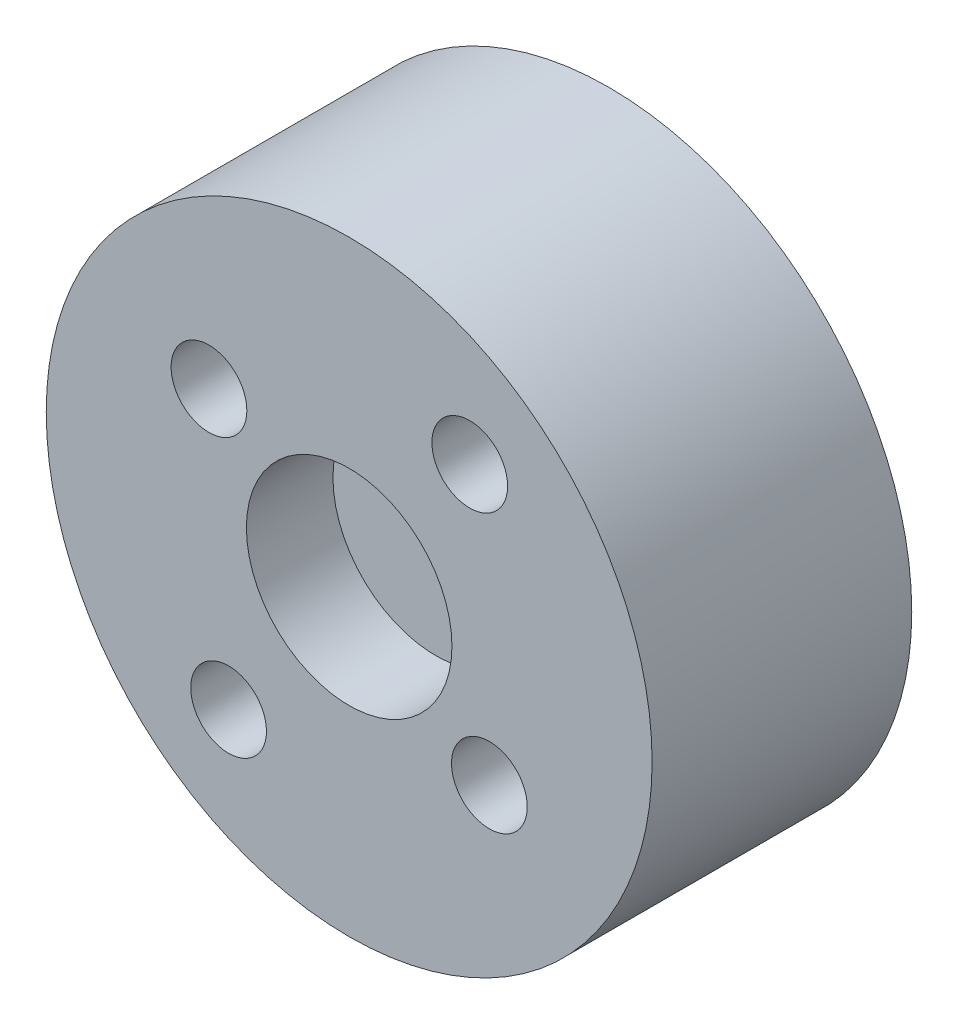
ISO-10303-21;
HEADER;
FILE_DESCRIPTION(('STEP AP214'),'2;1');
FILE_NAME('part.step','',(''),(''),'','','');
FILE_SCHEMA(('AUTOMOTIVE_DESIGN { 1 0 10303 214 1 1 1 1 }'));
ENDSEC;
DATA;
#1=APPLICATION_CONTEXT('core data for automotive mechanical design processes');
#2=APPLICATION_PROTOCOL_DEFINITION('international standard','automotive_design',2000,#1);
#3=PRODUCT_CONTEXT('',#1,'mechanical');
#4=PRODUCT('Part','Part','',(#3));
#5=PRODUCT_RELATED_PRODUCT_CATEGORY('part','',(#4));
#6=PRODUCT_DEFINITION_FORMATION('','',#4);
#7=PRODUCT_DEFINITION_CONTEXT('part definition',#1,'design');
#8=PRODUCT_DEFINITION('design','',#6,#7);
#9=PRODUCT_DEFINITION_SHAPE('','',#8);
#10=(LENGTH_UNIT() NAMED_UNIT(*) SI_UNIT(.MILLI.,.METRE.));
#11=(NAMED_UNIT(*) PLANE_ANGLE_UNIT() SI_UNIT($,.RADIAN.));
#12=(NAMED_UNIT(*) SI_UNIT($,.STERADIAN.) SOLID_ANGLE_UNIT());
#13=UNCERTAINTY_MEASURE_WITH_UNIT(LENGTH_MEASURE(1.E-05),#10,'distance_accuracy_value','');
#14=(GEOMETRIC_REPRESENTATION_CONTEXT(3) GLOBAL_UNCERTAINTY_ASSIGNED_CONTEXT((#13)) GLOBAL_UNIT_ASSIGNED_CONTEXT((#10,
#11,#12)) REPRESENTATION_CONTEXT('',''));
#15=CARTESIAN_POINT('',(0.,0.,0.));
#16=DIRECTION('',(0.,0.,1.));
#17=DIRECTION('',(1.,0.,0.));
#18=AXIS2_PLACEMENT_3D('',#15,#16,#17);
#19=CARTESIAN_POINT('',(0.,-2.76511214681213E-13,-39.5979797464465));
#20=DIRECTION('',(0.,0.,1.));
#21=DIRECTION('',(0.,-1.,0.));
#22=AXIS2_PLACEMENT_3D('',#19,#20,#21);
#23=CYLINDRICAL_SURFACE('',#22,14.);
#24=CARTESIAN_POINT('',(0.,0.,12.0000000000011));
#25=DIRECTION('',(0.,0.,-1.));
#26=DIRECTION('',(0.,1.,0.));
#27=AXIS2_PLACEMENT_3D('',#24,#25,#26);
#28=CIRCLE('',#27,14.);
#29=CARTESIAN_POINT('',(0.,14.0000000000001,12.000000000001));
#30=VERTEX_POINT('',#29);
#31=EDGE_CURVE('E38',#30,#30,#28,.T.);
#32=ORIENTED_EDGE('',*,*,#31,.T.);
#33=EDGE_LOOP('',(#32));
#34=FACE_BOUND('',#33,.T.);
#35=CARTESIAN_POINT('',(0.,0.,0.));
#36=DIRECTION('',(0.,0.,-1.));
#37=DIRECTION('',(-1.,0.,0.));
#38=AXIS2_PLACEMENT_3D('',#35,#36,#37);
#39=CIRCLE('',#38,14.);
#40=CARTESIAN_POINT('',(-14.,0.,0.));
#41=VERTEX_POINT('',#40);
#42=EDGE_CURVE('E10',#41,#41,#39,.T.);
#43=ORIENTED_EDGE('',*,*,#42,.F.);
#44=EDGE_LOOP('',(#43));
#45=FACE_BOUND('',#44,.T.);
#46=ADVANCED_FACE('F31',(#34,#45),#23,.T.);
#47=CARTESIAN_POINT('',(0.,0.,12.0000000000011));
#48=DIRECTION('',(0.,0.,-1.));
#49=DIRECTION('',(0.,1.,0.));
#50=AXIS2_PLACEMENT_3D('',#47,#48,#49);
#51=PLANE('',#50);
#52=CARTESIAN_POINT('',(0.,0.,12.0000000000011));
#53=DIRECTION('',(0.,0.,1.));
#54=DIRECTION('',(1.,0.,0.));
#55=AXIS2_PLACEMENT_3D('',#52,#53,#54);
#56=CIRCLE('',#55,4.75);
#57=CARTESIAN_POINT('',(4.75,0.,12.0000000000011));
#58=VERTEX_POINT('',#57);
#59=EDGE_CURVE('E70',#58,#58,#56,.T.);
#60=ORIENTED_EDGE('',*,*,#59,.F.);
#61=EDGE_LOOP('',(#60));
#62=FACE_BOUND('',#61,.T.);
#63=CARTESIAN_POINT('',(-5.57231761694233,-7.69410660024365,12.0000000000011));
#64=DIRECTION('',(0.,0.,1.));
#65=DIRECTION('',(1.,0.,0.));
#66=AXIS2_PLACEMENT_3D('',#63,#64,#65);
#67=CIRCLE('',#66,1.75);
#68=CARTESIAN_POINT('',(-3.82231761694233,-7.69410660024365,12.0000000000011));
#69=VERTEX_POINT('',#68);
#70=EDGE_CURVE('E52',#69,#69,#67,.T.);
#71=ORIENTED_EDGE('',*,*,#70,.F.);
#72=EDGE_LOOP('',(#71));
#73=FACE_BOUND('',#72,.T.);
#74=CARTESIAN_POINT('',(6.47924766336314,-4.69247799321451,12.0000000000011));
#75=DIRECTION('',(0.,0.,1.));
#76=DIRECTION('',(1.,0.,0.));
#77=AXIS2_PLACEMENT_3D('',#74,#75,#76);
#78=CIRCLE('',#77,1.75);
#79=CARTESIAN_POINT('',(8.22924766336314,-4.69247799321451,12.0000000000011));
#80=VERTEX_POINT('',#79);
#81=EDGE_CURVE('E59',#80,#80,#78,.T.);
#82=ORIENTED_EDGE('',*,*,#81,.F.);
#83=EDGE_LOOP('',(#82));
#84=FACE_BOUND('',#83,.T.);
#85=CARTESIAN_POINT('',(5.57231761694233,7.69410660024382,12.0000000000011));
#86=DIRECTION('',(0.,0.,1.));
#87=DIRECTION('',(1.,0.,0.));
#88=AXIS2_PLACEMENT_3D('',#85,#86,#87);
#89=CIRCLE('',#88,1.75);
#90=CARTESIAN_POINT('',(7.32231761694233,7.69410660024382,12.0000000000011));
#91=VERTEX_POINT('',#90);
#92=EDGE_CURVE('E65',#91,#91,#89,.T.);
#93=ORIENTED_EDGE('',*,*,#92,.F.);
#94=EDGE_LOOP('',(#93));
#95=FACE_BOUND('',#94,.T.);
#96=CARTESIAN_POINT('',(-6.47924766336314,4.69247799321468,12.0000000000011));
#97=DIRECTION('',(0.,0.,1.));
#98=DIRECTION('',(1.,0.,0.));
#99=AXIS2_PLACEMENT_3D('',#96,#97,#98);
#100=CIRCLE('',#99,1.75);
#101=CARTESIAN_POINT('',(-4.72924766336315,4.69247799321468,12.0000000000011));
#102=VERTEX_POINT('',#101);
#103=EDGE_CURVE('E46',#102,#102,#100,.T.);
#104=ORIENTED_EDGE('',*,*,#103,.F.);
#105=EDGE_LOOP('',(#104));
#106=FACE_BOUND('',#105,.T.);
#107=ORIENTED_EDGE('',*,*,#31,.F.);
#108=EDGE_LOOP('',(#107));
#109=FACE_BOUND('',#108,.T.);
#110=ADVANCED_FACE('F85',(#62,#73,#84,#95,#106,#109),#51,.F.);
#111=CARTESIAN_POINT('',(0.,0.,0.));
#112=DIRECTION('',(0.,0.,-1.));
#113=DIRECTION('',(0.,-1.,0.));
#114=AXIS2_PLACEMENT_3D('',#111,#112,#113);
#115=PLANE('',#114);
#116=CARTESIAN_POINT('',(-5.57231761694233,-7.69410660024365,0.));
#117=DIRECTION('',(0.,0.,1.));
#118=DIRECTION('',(1.,0.,0.));
#119=AXIS2_PLACEMENT_3D('',#116,#117,#118);
#120=CIRCLE('',#119,1.75);
#121=CARTESIAN_POINT('',(-3.82231761694233,-7.69410660024365,0.));
#122=VERTEX_POINT('',#121);
#123=EDGE_CURVE('E55',#122,#122,#120,.T.);
#124=ORIENTED_EDGE('',*,*,#123,.T.);
#125=EDGE_LOOP('',(#124));
#126=FACE_BOUND('',#125,.T.);
#127=CARTESIAN_POINT('',(6.47924766336314,-4.69247799321451,0.));
#128=DIRECTION('',(0.,0.,1.));
#129=DIRECTION('',(1.,0.,0.));
#130=AXIS2_PLACEMENT_3D('',#127,#128,#129);
#131=CIRCLE('',#130,1.75);
#132=CARTESIAN_POINT('',(8.22924766336314,-4.69247799321451,0.));
#133=VERTEX_POINT('',#132);
#134=EDGE_CURVE('E62',#133,#133,#131,.T.);
#135=ORIENTED_EDGE('',*,*,#134,.T.);
#136=EDGE_LOOP('',(#135));
#137=FACE_BOUND('',#136,.T.);
#138=CARTESIAN_POINT('',(5.57231761694233,7.69410660024382,0.));
#139=DIRECTION('',(0.,0.,1.));
#140=DIRECTION('',(1.,0.,0.));
#141=AXIS2_PLACEMENT_3D('',#138,#139,#140);
#142=CIRCLE('',#141,1.75);
#143=CARTESIAN_POINT('',(7.32231761694233,7.69410660024382,0.));
#144=VERTEX_POINT('',#143);
#145=EDGE_CURVE('E50',#144,#144,#142,.T.);
#146=ORIENTED_EDGE('',*,*,#145,.T.);
#147=EDGE_LOOP('',(#146));
#148=FACE_BOUND('',#147,.T.);
#149=CARTESIAN_POINT('',(-6.47924766336314,4.69247799321468,0.));
#150=DIRECTION('',(0.,0.,1.));
#151=DIRECTION('',(1.,0.,0.));
#152=AXIS2_PLACEMENT_3D('',#149,#150,#151);
#153=CIRCLE('',#152,1.75);
#154=CARTESIAN_POINT('',(-4.72924766336315,4.69247799321468,0.));
#155=VERTEX_POINT('',#154);
#156=EDGE_CURVE('E42',#155,#155,#153,.T.);
#157=ORIENTED_EDGE('',*,*,#156,.T.);
#158=EDGE_LOOP('',(#157));
#159=FACE_BOUND('',#158,.T.);
#160=ORIENTED_EDGE('',*,*,#42,.T.);
#161=EDGE_LOOP('',(#160));
#162=FACE_BOUND('',#161,.T.);
#163=ADVANCED_FACE('F33',(#126,#137,#148,#159,#162),#115,.T.);
#164=CARTESIAN_POINT('',(-6.47924766336314,4.69247799321468,0.));
#165=DIRECTION('',(0.,0.,1.));
#166=DIRECTION('',(1.,0.,0.));
#167=AXIS2_PLACEMENT_3D('',#164,#165,#166);
#168=CYLINDRICAL_SURFACE('',#167,1.75);
#169=ORIENTED_EDGE('',*,*,#156,.F.);
#170=EDGE_LOOP('',(#169));
#171=FACE_BOUND('',#170,.T.);
#172=ORIENTED_EDGE('',*,*,#103,.T.);
#173=EDGE_LOOP('',(#172));
#174=FACE_BOUND('',#173,.T.);
#175=ADVANCED_FACE('F98',(#171,#174),#168,.F.);
#176=CARTESIAN_POINT('',(5.57231761694233,7.69410660024382,0.));
#177=DIRECTION('',(0.,0.,1.));
#178=DIRECTION('',(1.,0.,0.));
#179=AXIS2_PLACEMENT_3D('',#176,#177,#178);
#180=CYLINDRICAL_SURFACE('',#179,1.75);
#181=ORIENTED_EDGE('',*,*,#145,.F.);
#182=EDGE_LOOP('',(#181));
#183=FACE_BOUND('',#182,.T.);
#184=ORIENTED_EDGE('',*,*,#92,.T.);
#185=EDGE_LOOP('',(#184));
#186=FACE_BOUND('',#185,.T.);
#187=ADVANCED_FACE('F100',(#183,#186),#180,.F.);
#188=CARTESIAN_POINT('',(6.47924766336314,-4.69247799321451,0.));
#189=DIRECTION('',(0.,0.,1.));
#190=DIRECTION('',(1.,0.,0.));
#191=AXIS2_PLACEMENT_3D('',#188,#189,#190);
#192=CYLINDRICAL_SURFACE('',#191,1.75);
#193=ORIENTED_EDGE('',*,*,#134,.F.);
#194=EDGE_LOOP('',(#193));
#195=FACE_BOUND('',#194,.T.);
#196=ORIENTED_EDGE('',*,*,#81,.T.);
#197=EDGE_LOOP('',(#196));
#198=FACE_BOUND('',#197,.T.);
#199=ADVANCED_FACE('F107',(#195,#198),#192,.F.);
#200=CARTESIAN_POINT('',(-5.57231761694233,-7.69410660024365,0.));
#201=DIRECTION('',(0.,0.,1.));
#202=DIRECTION('',(1.,0.,0.));
#203=AXIS2_PLACEMENT_3D('',#200,#201,#202);
#204=CYLINDRICAL_SURFACE('',#203,1.75);
#205=ORIENTED_EDGE('',*,*,#123,.F.);
#206=EDGE_LOOP('',(#205));
#207=FACE_BOUND('',#206,.T.);
#208=ORIENTED_EDGE('',*,*,#70,.T.);
#209=EDGE_LOOP('',(#208));
#210=FACE_BOUND('',#209,.T.);
#211=ADVANCED_FACE('F81',(#207,#210),#204,.F.);
#212=CARTESIAN_POINT('',(0.,0.,8.00000000000107));
#213=DIRECTION('',(0.,0.,1.));
#214=DIRECTION('',(1.,0.,0.));
#215=AXIS2_PLACEMENT_3D('',#212,#213,#214);
#216=CYLINDRICAL_SURFACE('',#215,4.75);
#217=CARTESIAN_POINT('',(0.,0.,8.00000000000107));
#218=DIRECTION('',(0.,0.,1.));
#219=DIRECTION('',(1.,0.,0.));
#220=AXIS2_PLACEMENT_3D('',#217,#218,#219);
#221=CIRCLE('',#220,4.75);
#222=CARTESIAN_POINT('',(4.75,0.,8.00000000000107));
#223=VERTEX_POINT('',#222);
#224=EDGE_CURVE('E56',#223,#223,#221,.T.);
#225=ORIENTED_EDGE('',*,*,#224,.F.);
#226=EDGE_LOOP('',(#225));
#227=FACE_BOUND('',#226,.T.);
#228=ORIENTED_EDGE('',*,*,#59,.T.);
#229=EDGE_LOOP('',(#228));
#230=FACE_BOUND('',#229,.T.);
#231=ADVANCED_FACE('F78',(#227,#230),#216,.F.);
#232=CARTESIAN_POINT('',(0.,0.,8.00000000000107));
#233=DIRECTION('',(0.,0.,1.));
#234=DIRECTION('',(1.,0.,0.));
#235=AXIS2_PLACEMENT_3D('',#232,#233,#234);
#236=PLANE('',#235);
#237=ORIENTED_EDGE('',*,*,#224,.T.);
#238=EDGE_LOOP('',(#237));
#239=FACE_BOUND('',#238,.T.);
#240=ADVANCED_FACE('F76',(#239),#236,.T.);
#241=CLOSED_SHELL('',(#46,#110,#163,#175,#187,#199,#211,#231,#240));
#242=MANIFOLD_SOLID_BREP('B2',#241);
#243=ADVANCED_BREP_SHAPE_REPRESENTATION('',(#18,#242),#14);
#244=SHAPE_DEFINITION_REPRESENTATION(#9,#243);
ENDSEC;
END-ISO-10303-21;
